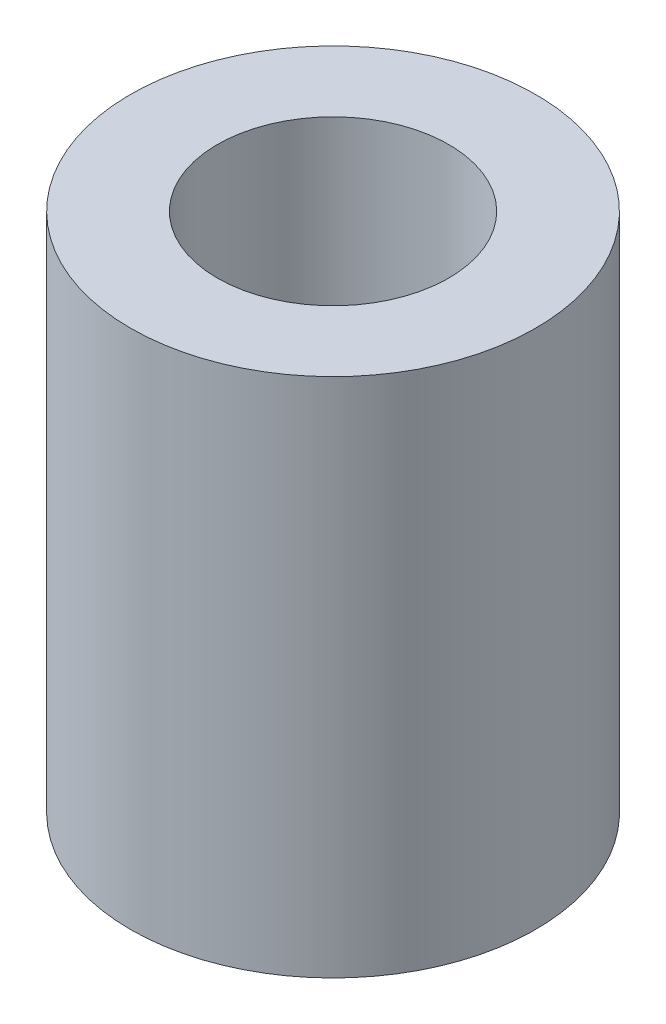
ISO-10303-21;
HEADER;
FILE_DESCRIPTION(('STEP AP214'),'2;1');
FILE_NAME('part.step','',(''),(''),'','','');
FILE_SCHEMA(('AUTOMOTIVE_DESIGN { 1 0 10303 214 1 1 1 1 }'));
ENDSEC;
DATA;
#1=APPLICATION_CONTEXT('core data for automotive mechanical design processes');
#2=APPLICATION_PROTOCOL_DEFINITION('international standard','automotive_design',2000,#1);
#3=PRODUCT_CONTEXT('',#1,'mechanical');
#4=PRODUCT('Part','Part','',(#3));
#5=PRODUCT_RELATED_PRODUCT_CATEGORY('part','',(#4));
#6=PRODUCT_DEFINITION_FORMATION('','',#4);
#7=PRODUCT_DEFINITION_CONTEXT('part definition',#1,'design');
#8=PRODUCT_DEFINITION('design','',#6,#7);
#9=PRODUCT_DEFINITION_SHAPE('','',#8);
#10=(LENGTH_UNIT() NAMED_UNIT(*) SI_UNIT(.MILLI.,.METRE.));
#11=(NAMED_UNIT(*) PLANE_ANGLE_UNIT() SI_UNIT($,.RADIAN.));
#12=(NAMED_UNIT(*) SI_UNIT($,.STERADIAN.) SOLID_ANGLE_UNIT());
#13=UNCERTAINTY_MEASURE_WITH_UNIT(LENGTH_MEASURE(1.E-05),#10,'distance_accuracy_value','');
#14=(GEOMETRIC_REPRESENTATION_CONTEXT(3) GLOBAL_UNCERTAINTY_ASSIGNED_CONTEXT((#13)) GLOBAL_UNIT_ASSIGNED_CONTEXT((#10,
#11,#12)) REPRESENTATION_CONTEXT('',''));
#15=CARTESIAN_POINT('',(0.,0.,0.));
#16=DIRECTION('',(0.,0.,1.));
#17=DIRECTION('',(1.,0.,0.));
#18=AXIS2_PLACEMENT_3D('',#15,#16,#17);
#19=CARTESIAN_POINT('',(0.,45.,0.));
#20=DIRECTION('',(0.,1.,0.));
#21=DIRECTION('',(0.,0.,1.));
#22=AXIS2_PLACEMENT_3D('',#19,#20,#21);
#23=PLANE('',#22);
#24=CARTESIAN_POINT('',(0.,45.,0.));
#25=DIRECTION('',(0.,1.,0.));
#26=DIRECTION('',(0.,0.,1.));
#27=AXIS2_PLACEMENT_3D('',#24,#25,#26);
#28=CIRCLE('',#27,17.5);
#29=CARTESIAN_POINT('',(0.,45.,17.5));
#30=VERTEX_POINT('',#29);
#31=EDGE_CURVE('E10',#30,#30,#28,.T.);
#32=ORIENTED_EDGE('',*,*,#31,.T.);
#33=EDGE_LOOP('',(#32));
#34=FACE_BOUND('',#33,.T.);
#35=CARTESIAN_POINT('',(0.,45.,0.));
#36=DIRECTION('',(0.,1.,0.));
#37=DIRECTION('',(0.,0.,1.));
#38=AXIS2_PLACEMENT_3D('',#35,#36,#37);
#39=CIRCLE('',#38,10.);
#40=CARTESIAN_POINT('',(0.,45.,10.));
#41=VERTEX_POINT('',#40);
#42=EDGE_CURVE('E42',#41,#41,#39,.T.);
#43=ORIENTED_EDGE('',*,*,#42,.F.);
#44=EDGE_LOOP('',(#43));
#45=FACE_BOUND('',#44,.T.);
#46=ADVANCED_FACE('F31',(#34,#45),#23,.T.);
#47=CARTESIAN_POINT('',(0.,0.,0.));
#48=DIRECTION('',(0.,1.,0.));
#49=DIRECTION('',(0.,0.,1.));
#50=AXIS2_PLACEMENT_3D('',#47,#48,#49);
#51=PLANE('',#50);
#52=CARTESIAN_POINT('',(0.,0.,0.));
#53=DIRECTION('',(0.,1.,0.));
#54=DIRECTION('',(0.,0.,1.));
#55=AXIS2_PLACEMENT_3D('',#52,#53,#54);
#56=CIRCLE('',#55,17.5);
#57=CARTESIAN_POINT('',(0.,0.,17.5));
#58=VERTEX_POINT('',#57);
#59=EDGE_CURVE('E35',#58,#58,#56,.T.);
#60=ORIENTED_EDGE('',*,*,#59,.F.);
#61=EDGE_LOOP('',(#60));
#62=FACE_BOUND('',#61,.T.);
#63=CARTESIAN_POINT('',(0.,0.,0.));
#64=DIRECTION('',(0.,1.,0.));
#65=DIRECTION('',(0.,0.,1.));
#66=AXIS2_PLACEMENT_3D('',#63,#64,#65);
#67=CIRCLE('',#66,10.);
#68=CARTESIAN_POINT('',(0.,0.,10.));
#69=VERTEX_POINT('',#68);
#70=EDGE_CURVE('E44',#69,#69,#67,.T.);
#71=ORIENTED_EDGE('',*,*,#70,.T.);
#72=EDGE_LOOP('',(#71));
#73=FACE_BOUND('',#72,.T.);
#74=ADVANCED_FACE('F54',(#62,#73),#51,.F.);
#75=CARTESIAN_POINT('',(0.,45.,0.));
#76=DIRECTION('',(0.,-1.,0.));
#77=DIRECTION('',(0.,0.,-1.));
#78=AXIS2_PLACEMENT_3D('',#75,#76,#77);
#79=CYLINDRICAL_SURFACE('',#78,17.5);
#80=ORIENTED_EDGE('',*,*,#31,.F.);
#81=EDGE_LOOP('',(#80));
#82=FACE_BOUND('',#81,.T.);
#83=ORIENTED_EDGE('',*,*,#59,.T.);
#84=EDGE_LOOP('',(#83));
#85=FACE_BOUND('',#84,.T.);
#86=ADVANCED_FACE('F33',(#82,#85),#79,.T.);
#87=CARTESIAN_POINT('',(0.,45.,0.));
#88=DIRECTION('',(0.,-1.,0.));
#89=DIRECTION('',(0.,0.,-1.));
#90=AXIS2_PLACEMENT_3D('',#87,#88,#89);
#91=CYLINDRICAL_SURFACE('',#90,10.);
#92=ORIENTED_EDGE('',*,*,#42,.T.);
#93=EDGE_LOOP('',(#92));
#94=FACE_BOUND('',#93,.T.);
#95=ORIENTED_EDGE('',*,*,#70,.F.);
#96=EDGE_LOOP('',(#95));
#97=FACE_BOUND('',#96,.T.);
#98=ADVANCED_FACE('F50',(#94,#97),#91,.F.);
#99=CLOSED_SHELL('',(#46,#74,#86,#98));
#100=MANIFOLD_SOLID_BREP('B2',#99);
#101=ADVANCED_BREP_SHAPE_REPRESENTATION('',(#18,#100),#14);
#102=SHAPE_DEFINITION_REPRESENTATION(#9,#101);
ENDSEC;
END-ISO-10303-21;
